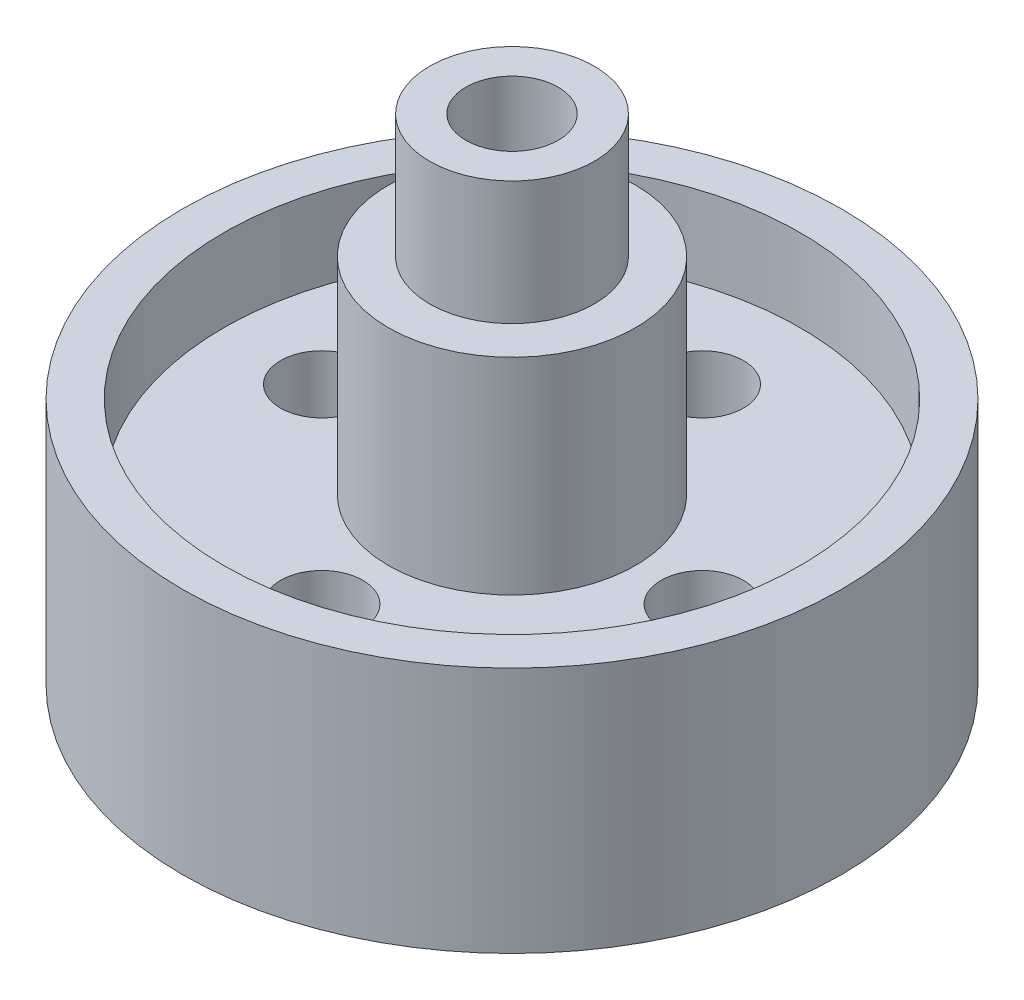
ISO-10303-21;
HEADER;
FILE_DESCRIPTION(('STEP AP214'),'2;1');
FILE_NAME('part.step','',(''),(''),'','','');
FILE_SCHEMA(('AUTOMOTIVE_DESIGN { 1 0 10303 214 1 1 1 1 }'));
ENDSEC;
DATA;
#1=APPLICATION_CONTEXT('core data for automotive mechanical design processes');
#2=APPLICATION_PROTOCOL_DEFINITION('international standard','automotive_design',2000,#1);
#3=PRODUCT_CONTEXT('',#1,'mechanical');
#4=PRODUCT('Part','Part','',(#3));
#5=PRODUCT_RELATED_PRODUCT_CATEGORY('part','',(#4));
#6=PRODUCT_DEFINITION_FORMATION('','',#4);
#7=PRODUCT_DEFINITION_CONTEXT('part definition',#1,'design');
#8=PRODUCT_DEFINITION('design','',#6,#7);
#9=PRODUCT_DEFINITION_SHAPE('','',#8);
#10=(LENGTH_UNIT() NAMED_UNIT(*) SI_UNIT(.MILLI.,.METRE.));
#11=(NAMED_UNIT(*) PLANE_ANGLE_UNIT() SI_UNIT($,.RADIAN.));
#12=(NAMED_UNIT(*) SI_UNIT($,.STERADIAN.) SOLID_ANGLE_UNIT());
#13=UNCERTAINTY_MEASURE_WITH_UNIT(LENGTH_MEASURE(1.E-05),#10,'distance_accuracy_value','');
#14=(GEOMETRIC_REPRESENTATION_CONTEXT(3) GLOBAL_UNCERTAINTY_ASSIGNED_CONTEXT((#13)) GLOBAL_UNIT_ASSIGNED_CONTEXT((#10,
#11,#12)) REPRESENTATION_CONTEXT('',''));
#15=CARTESIAN_POINT('',(0.,0.,0.));
#16=DIRECTION('',(0.,0.,1.));
#17=DIRECTION('',(1.,0.,0.));
#18=AXIS2_PLACEMENT_3D('',#15,#16,#17);
#19=CARTESIAN_POINT('',(0.,38.1,0.));
#20=DIRECTION('',(0.,-1.,0.));
#21=DIRECTION('',(0.,0.,-1.));
#22=AXIS2_PLACEMENT_3D('',#19,#20,#21);
#23=CYLINDRICAL_SURFACE('',#22,44.45);
#24=CARTESIAN_POINT('',(0.,25.4,0.));
#25=DIRECTION('',(0.,1.,0.));
#26=DIRECTION('',(0.,0.,1.));
#27=AXIS2_PLACEMENT_3D('',#24,#25,#26);
#28=CIRCLE('',#27,44.45);
#29=CARTESIAN_POINT('',(0.,25.4,44.45));
#30=VERTEX_POINT('',#29);
#31=EDGE_CURVE('E10',#30,#30,#28,.T.);
#32=ORIENTED_EDGE('',*,*,#31,.F.);
#33=EDGE_LOOP('',(#32));
#34=FACE_BOUND('',#33,.T.);
#35=CARTESIAN_POINT('',(0.,38.1,0.));
#36=DIRECTION('',(0.,1.,0.));
#37=DIRECTION('',(0.,0.,1.));
#38=AXIS2_PLACEMENT_3D('',#35,#36,#37);
#39=CIRCLE('',#38,44.45);
#40=CARTESIAN_POINT('',(0.,38.1,44.45));
#41=VERTEX_POINT('',#40);
#42=EDGE_CURVE('E47',#41,#41,#39,.T.);
#43=ORIENTED_EDGE('',*,*,#42,.T.);
#44=EDGE_LOOP('',(#43));
#45=FACE_BOUND('',#44,.T.);
#46=ADVANCED_FACE('F37',(#34,#45),#23,.F.);
#47=CARTESIAN_POINT('',(0.,38.1,0.));
#48=DIRECTION('',(0.,-1.,0.));
#49=DIRECTION('',(0.,0.,-1.));
#50=AXIS2_PLACEMENT_3D('',#47,#48,#49);
#51=CYLINDRICAL_SURFACE('',#50,50.8);
#52=CARTESIAN_POINT('',(0.,38.1,0.));
#53=DIRECTION('',(0.,1.,0.));
#54=DIRECTION('',(0.,0.,1.));
#55=AXIS2_PLACEMENT_3D('',#52,#53,#54);
#56=CIRCLE('',#55,50.8);
#57=CARTESIAN_POINT('',(0.,38.1,50.8));
#58=VERTEX_POINT('',#57);
#59=EDGE_CURVE('E43',#58,#58,#56,.T.);
#60=ORIENTED_EDGE('',*,*,#59,.F.);
#61=EDGE_LOOP('',(#60));
#62=FACE_BOUND('',#61,.T.);
#63=CARTESIAN_POINT('',(0.,0.,0.));
#64=DIRECTION('',(0.,1.,0.));
#65=DIRECTION('',(0.,0.,1.));
#66=AXIS2_PLACEMENT_3D('',#63,#64,#65);
#67=CIRCLE('',#66,50.8);
#68=CARTESIAN_POINT('',(0.,0.,50.8));
#69=VERTEX_POINT('',#68);
#70=EDGE_CURVE('E52',#69,#69,#67,.T.);
#71=ORIENTED_EDGE('',*,*,#70,.T.);
#72=EDGE_LOOP('',(#71));
#73=FACE_BOUND('',#72,.T.);
#74=ADVANCED_FACE('F123',(#62,#73),#51,.T.);
#75=CARTESIAN_POINT('',(0.,38.1,0.));
#76=DIRECTION('',(0.,1.,0.));
#77=DIRECTION('',(0.,0.,1.));
#78=AXIS2_PLACEMENT_3D('',#75,#76,#77);
#79=PLANE('',#78);
#80=ORIENTED_EDGE('',*,*,#42,.F.);
#81=EDGE_LOOP('',(#80));
#82=FACE_BOUND('',#81,.T.);
#83=ORIENTED_EDGE('',*,*,#59,.T.);
#84=EDGE_LOOP('',(#83));
#85=FACE_BOUND('',#84,.T.);
#86=ADVANCED_FACE('F119',(#82,#85),#79,.T.);
#87=CARTESIAN_POINT('',(0.,0.,0.));
#88=DIRECTION('',(0.,1.,0.));
#89=DIRECTION('',(0.,0.,1.));
#90=AXIS2_PLACEMENT_3D('',#87,#88,#89);
#91=PLANE('',#90);
#92=ORIENTED_EDGE('',*,*,#70,.F.);
#93=EDGE_LOOP('',(#92));
#94=FACE_BOUND('',#93,.T.);
#95=CARTESIAN_POINT('',(-29.337,0.,0.));
#96=DIRECTION('',(0.,1.,0.));
#97=DIRECTION('',(0.,0.,1.));
#98=AXIS2_PLACEMENT_3D('',#95,#96,#97);
#99=CIRCLE('',#98,6.35);
#100=CARTESIAN_POINT('',(-29.337,0.,6.35));
#101=VERTEX_POINT('',#100);
#102=EDGE_CURVE('E69',#101,#101,#99,.T.);
#103=ORIENTED_EDGE('',*,*,#102,.T.);
#104=EDGE_LOOP('',(#103));
#105=FACE_BOUND('',#104,.T.);
#106=CARTESIAN_POINT('',(0.,0.,-29.337));
#107=DIRECTION('',(0.,1.,0.));
#108=DIRECTION('',(0.,0.,1.));
#109=AXIS2_PLACEMENT_3D('',#106,#107,#108);
#110=CIRCLE('',#109,6.35);
#111=CARTESIAN_POINT('',(0.,0.,-22.987));
#112=VERTEX_POINT('',#111);
#113=EDGE_CURVE('E72',#112,#112,#110,.T.);
#114=ORIENTED_EDGE('',*,*,#113,.T.);
#115=EDGE_LOOP('',(#114));
#116=FACE_BOUND('',#115,.T.);
#117=CARTESIAN_POINT('',(29.337,0.,0.));
#118=DIRECTION('',(0.,1.,0.));
#119=DIRECTION('',(0.,0.,1.));
#120=AXIS2_PLACEMENT_3D('',#117,#118,#119);
#121=CIRCLE('',#120,6.35);
#122=CARTESIAN_POINT('',(29.337,0.,6.35));
#123=VERTEX_POINT('',#122);
#124=EDGE_CURVE('E76',#123,#123,#121,.T.);
#125=ORIENTED_EDGE('',*,*,#124,.T.);
#126=EDGE_LOOP('',(#125));
#127=FACE_BOUND('',#126,.T.);
#128=CARTESIAN_POINT('',(0.,0.,29.337));
#129=DIRECTION('',(0.,1.,0.));
#130=DIRECTION('',(0.,0.,1.));
#131=AXIS2_PLACEMENT_3D('',#128,#129,#130);
#132=CIRCLE('',#131,6.35);
#133=CARTESIAN_POINT('',(0.,0.,35.687));
#134=VERTEX_POINT('',#133);
#135=EDGE_CURVE('E78',#134,#134,#132,.T.);
#136=ORIENTED_EDGE('',*,*,#135,.T.);
#137=EDGE_LOOP('',(#136));
#138=FACE_BOUND('',#137,.T.);
#139=CARTESIAN_POINT('',(0.,0.,0.));
#140=DIRECTION('',(0.,1.,0.));
#141=DIRECTION('',(0.,0.,1.));
#142=AXIS2_PLACEMENT_3D('',#139,#140,#141);
#143=CIRCLE('',#142,7.112);
#144=CARTESIAN_POINT('',(0.,0.,7.112));
#145=VERTEX_POINT('',#144);
#146=EDGE_CURVE('E152',#145,#145,#143,.T.);
#147=ORIENTED_EDGE('',*,*,#146,.T.);
#148=EDGE_LOOP('',(#147));
#149=FACE_BOUND('',#148,.T.);
#150=ADVANCED_FACE('F111',(#94,#105,#116,#127,#138,#149),#91,.F.);
#151=CARTESIAN_POINT('',(0.,25.4,29.337));
#152=DIRECTION('',(0.,-1.,0.));
#153=DIRECTION('',(0.,0.,-1.));
#154=AXIS2_PLACEMENT_3D('',#151,#152,#153);
#155=CYLINDRICAL_SURFACE('',#154,6.35);
#156=CARTESIAN_POINT('',(0.,25.4,29.337));
#157=DIRECTION('',(0.,1.,0.));
#158=DIRECTION('',(0.,0.,1.));
#159=AXIS2_PLACEMENT_3D('',#156,#157,#158);
#160=CIRCLE('',#159,6.35);
#161=CARTESIAN_POINT('',(0.,25.4,35.687));
#162=VERTEX_POINT('',#161);
#163=EDGE_CURVE('E60',#162,#162,#160,.T.);
#164=ORIENTED_EDGE('',*,*,#163,.T.);
#165=EDGE_LOOP('',(#164));
#166=FACE_BOUND('',#165,.T.);
#167=ORIENTED_EDGE('',*,*,#135,.F.);
#168=EDGE_LOOP('',(#167));
#169=FACE_BOUND('',#168,.T.);
#170=ADVANCED_FACE('F108',(#166,#169),#155,.F.);
#171=CARTESIAN_POINT('',(29.337,25.4,0.));
#172=DIRECTION('',(0.,-1.,0.));
#173=DIRECTION('',(0.,0.,-1.));
#174=AXIS2_PLACEMENT_3D('',#171,#172,#173);
#175=CYLINDRICAL_SURFACE('',#174,6.35);
#176=CARTESIAN_POINT('',(29.337,25.4,0.));
#177=DIRECTION('',(0.,1.,0.));
#178=DIRECTION('',(0.,0.,1.));
#179=AXIS2_PLACEMENT_3D('',#176,#177,#178);
#180=CIRCLE('',#179,6.35);
#181=CARTESIAN_POINT('',(29.337,25.4,6.35));
#182=VERTEX_POINT('',#181);
#183=EDGE_CURVE('E65',#182,#182,#180,.T.);
#184=ORIENTED_EDGE('',*,*,#183,.T.);
#185=EDGE_LOOP('',(#184));
#186=FACE_BOUND('',#185,.T.);
#187=ORIENTED_EDGE('',*,*,#124,.F.);
#188=EDGE_LOOP('',(#187));
#189=FACE_BOUND('',#188,.T.);
#190=ADVANCED_FACE('F95',(#186,#189),#175,.F.);
#191=CARTESIAN_POINT('',(0.,25.4,-29.337));
#192=DIRECTION('',(0.,-1.,0.));
#193=DIRECTION('',(0.,0.,-1.));
#194=AXIS2_PLACEMENT_3D('',#191,#192,#193);
#195=CYLINDRICAL_SURFACE('',#194,6.35);
#196=CARTESIAN_POINT('',(0.,25.4,-29.337));
#197=DIRECTION('',(0.,1.,0.));
#198=DIRECTION('',(0.,0.,1.));
#199=AXIS2_PLACEMENT_3D('',#196,#197,#198);
#200=CIRCLE('',#199,6.35);
#201=CARTESIAN_POINT('',(0.,25.4,-22.987));
#202=VERTEX_POINT('',#201);
#203=EDGE_CURVE('E84',#202,#202,#200,.T.);
#204=ORIENTED_EDGE('',*,*,#203,.T.);
#205=EDGE_LOOP('',(#204));
#206=FACE_BOUND('',#205,.T.);
#207=ORIENTED_EDGE('',*,*,#113,.F.);
#208=EDGE_LOOP('',(#207));
#209=FACE_BOUND('',#208,.T.);
#210=ADVANCED_FACE('F117',(#206,#209),#195,.F.);
#211=CARTESIAN_POINT('',(-29.337,25.4,0.));
#212=DIRECTION('',(0.,-1.,0.));
#213=DIRECTION('',(0.,0.,-1.));
#214=AXIS2_PLACEMENT_3D('',#211,#212,#213);
#215=CYLINDRICAL_SURFACE('',#214,6.35);
#216=CARTESIAN_POINT('',(-29.337,25.4,0.));
#217=DIRECTION('',(0.,1.,0.));
#218=DIRECTION('',(0.,0.,1.));
#219=AXIS2_PLACEMENT_3D('',#216,#217,#218);
#220=CIRCLE('',#219,6.35);
#221=CARTESIAN_POINT('',(-29.337,25.4,6.35));
#222=VERTEX_POINT('',#221);
#223=EDGE_CURVE('E80',#222,#222,#220,.T.);
#224=ORIENTED_EDGE('',*,*,#223,.T.);
#225=EDGE_LOOP('',(#224));
#226=FACE_BOUND('',#225,.T.);
#227=ORIENTED_EDGE('',*,*,#102,.F.);
#228=EDGE_LOOP('',(#227));
#229=FACE_BOUND('',#228,.T.);
#230=ADVANCED_FACE('F102',(#226,#229),#215,.F.);
#231=CARTESIAN_POINT('',(0.,25.4,0.));
#232=DIRECTION('',(0.,1.,0.));
#233=DIRECTION('',(0.,0.,1.));
#234=AXIS2_PLACEMENT_3D('',#231,#232,#233);
#235=PLANE('',#234);
#236=ORIENTED_EDGE('',*,*,#223,.F.);
#237=EDGE_LOOP('',(#236));
#238=FACE_BOUND('',#237,.T.);
#239=ORIENTED_EDGE('',*,*,#203,.F.);
#240=EDGE_LOOP('',(#239));
#241=FACE_BOUND('',#240,.T.);
#242=ORIENTED_EDGE('',*,*,#183,.F.);
#243=EDGE_LOOP('',(#242));
#244=FACE_BOUND('',#243,.T.);
#245=ORIENTED_EDGE('',*,*,#163,.F.);
#246=EDGE_LOOP('',(#245));
#247=FACE_BOUND('',#246,.T.);
#248=ORIENTED_EDGE('',*,*,#31,.T.);
#249=EDGE_LOOP('',(#248));
#250=FACE_BOUND('',#249,.T.);
#251=CARTESIAN_POINT('',(0.,25.4,0.));
#252=DIRECTION('',(0.,1.,0.));
#253=DIRECTION('',(0.,0.,1.));
#254=AXIS2_PLACEMENT_3D('',#251,#252,#253);
#255=CIRCLE('',#254,19.05);
#256=CARTESIAN_POINT('',(0.,25.4,19.05));
#257=VERTEX_POINT('',#256);
#258=EDGE_CURVE('E56',#257,#257,#255,.T.);
#259=ORIENTED_EDGE('',*,*,#258,.F.);
#260=EDGE_LOOP('',(#259));
#261=FACE_BOUND('',#260,.T.);
#262=ADVANCED_FACE('F98',(#238,#241,#244,#247,#250,#261),#235,.T.);
#263=CARTESIAN_POINT('',(0.,57.15,0.));
#264=DIRECTION('',(0.,-1.,0.));
#265=DIRECTION('',(0.,0.,-1.));
#266=AXIS2_PLACEMENT_3D('',#263,#264,#265);
#267=CYLINDRICAL_SURFACE('',#266,19.05);
#268=ORIENTED_EDGE('',*,*,#258,.T.);
#269=EDGE_LOOP('',(#268));
#270=FACE_BOUND('',#269,.T.);
#271=CARTESIAN_POINT('',(0.,57.15,0.));
#272=DIRECTION('',(0.,1.,0.));
#273=DIRECTION('',(0.,0.,1.));
#274=AXIS2_PLACEMENT_3D('',#271,#272,#273);
#275=CIRCLE('',#274,19.05);
#276=CARTESIAN_POINT('',(0.,57.15,19.05));
#277=VERTEX_POINT('',#276);
#278=EDGE_CURVE('E73',#277,#277,#275,.T.);
#279=ORIENTED_EDGE('',*,*,#278,.F.);
#280=EDGE_LOOP('',(#279));
#281=FACE_BOUND('',#280,.T.);
#282=ADVANCED_FACE('F101',(#270,#281),#267,.T.);
#283=CARTESIAN_POINT('',(0.,57.15,0.));
#284=DIRECTION('',(0.,1.,0.));
#285=DIRECTION('',(0.,0.,1.));
#286=AXIS2_PLACEMENT_3D('',#283,#284,#285);
#287=PLANE('',#286);
#288=CARTESIAN_POINT('',(0.,57.15,0.));
#289=DIRECTION('',(0.,1.,0.));
#290=DIRECTION('',(0.,0.,1.));
#291=AXIS2_PLACEMENT_3D('',#288,#289,#290);
#292=CIRCLE('',#291,12.7);
#293=CARTESIAN_POINT('',(0.,57.15,12.7));
#294=VERTEX_POINT('',#293);
#295=EDGE_CURVE('E160',#294,#294,#292,.T.);
#296=ORIENTED_EDGE('',*,*,#295,.F.);
#297=EDGE_LOOP('',(#296));
#298=FACE_BOUND('',#297,.T.);
#299=ORIENTED_EDGE('',*,*,#278,.T.);
#300=EDGE_LOOP('',(#299));
#301=FACE_BOUND('',#300,.T.);
#302=ADVANCED_FACE('F180',(#298,#301),#287,.T.);
#303=CARTESIAN_POINT('',(0.,76.2,0.));
#304=DIRECTION('',(0.,-1.,0.));
#305=DIRECTION('',(0.,0.,-1.));
#306=AXIS2_PLACEMENT_3D('',#303,#304,#305);
#307=CYLINDRICAL_SURFACE('',#306,7.112);
#308=CARTESIAN_POINT('',(0.,76.2,0.));
#309=DIRECTION('',(0.,1.,0.));
#310=DIRECTION('',(0.,0.,1.));
#311=AXIS2_PLACEMENT_3D('',#308,#309,#310);
#312=CIRCLE('',#311,7.112);
#313=CARTESIAN_POINT('',(0.,76.2,7.112));
#314=VERTEX_POINT('',#313);
#315=EDGE_CURVE('E154',#314,#314,#312,.T.);
#316=ORIENTED_EDGE('',*,*,#315,.T.);
#317=EDGE_LOOP('',(#316));
#318=FACE_BOUND('',#317,.T.);
#319=ORIENTED_EDGE('',*,*,#146,.F.);
#320=EDGE_LOOP('',(#319));
#321=FACE_BOUND('',#320,.T.);
#322=ADVANCED_FACE('F172',(#318,#321),#307,.F.);
#323=CARTESIAN_POINT('',(0.,76.2,0.));
#324=DIRECTION('',(0.,-1.,0.));
#325=DIRECTION('',(0.,0.,-1.));
#326=AXIS2_PLACEMENT_3D('',#323,#324,#325);
#327=CYLINDRICAL_SURFACE('',#326,12.7);
#328=ORIENTED_EDGE('',*,*,#295,.T.);
#329=EDGE_LOOP('',(#328));
#330=FACE_BOUND('',#329,.T.);
#331=CARTESIAN_POINT('',(0.,76.2,0.));
#332=DIRECTION('',(0.,1.,0.));
#333=DIRECTION('',(0.,0.,1.));
#334=AXIS2_PLACEMENT_3D('',#331,#332,#333);
#335=CIRCLE('',#334,12.7);
#336=CARTESIAN_POINT('',(0.,76.2,12.7));
#337=VERTEX_POINT('',#336);
#338=EDGE_CURVE('E157',#337,#337,#335,.T.);
#339=ORIENTED_EDGE('',*,*,#338,.F.);
#340=EDGE_LOOP('',(#339));
#341=FACE_BOUND('',#340,.T.);
#342=ADVANCED_FACE('F170',(#330,#341),#327,.T.);
#343=CARTESIAN_POINT('',(0.,76.2,0.));
#344=DIRECTION('',(0.,1.,0.));
#345=DIRECTION('',(0.,0.,1.));
#346=AXIS2_PLACEMENT_3D('',#343,#344,#345);
#347=PLANE('',#346);
#348=ORIENTED_EDGE('',*,*,#315,.F.);
#349=EDGE_LOOP('',(#348));
#350=FACE_BOUND('',#349,.T.);
#351=ORIENTED_EDGE('',*,*,#338,.T.);
#352=EDGE_LOOP('',(#351));
#353=FACE_BOUND('',#352,.T.);
#354=ADVANCED_FACE('F168',(#350,#353),#347,.T.);
#355=CLOSED_SHELL('',(#46,#74,#86,#150,#170,#190,#210,#230,#262,#282,#302,#322,#342,#354));
#356=MANIFOLD_SOLID_BREP('B2',#355);
#357=ADVANCED_BREP_SHAPE_REPRESENTATION('',(#18,#356),#14);
#358=SHAPE_DEFINITION_REPRESENTATION(#9,#357);
ENDSEC;
END-ISO-10303-21;
